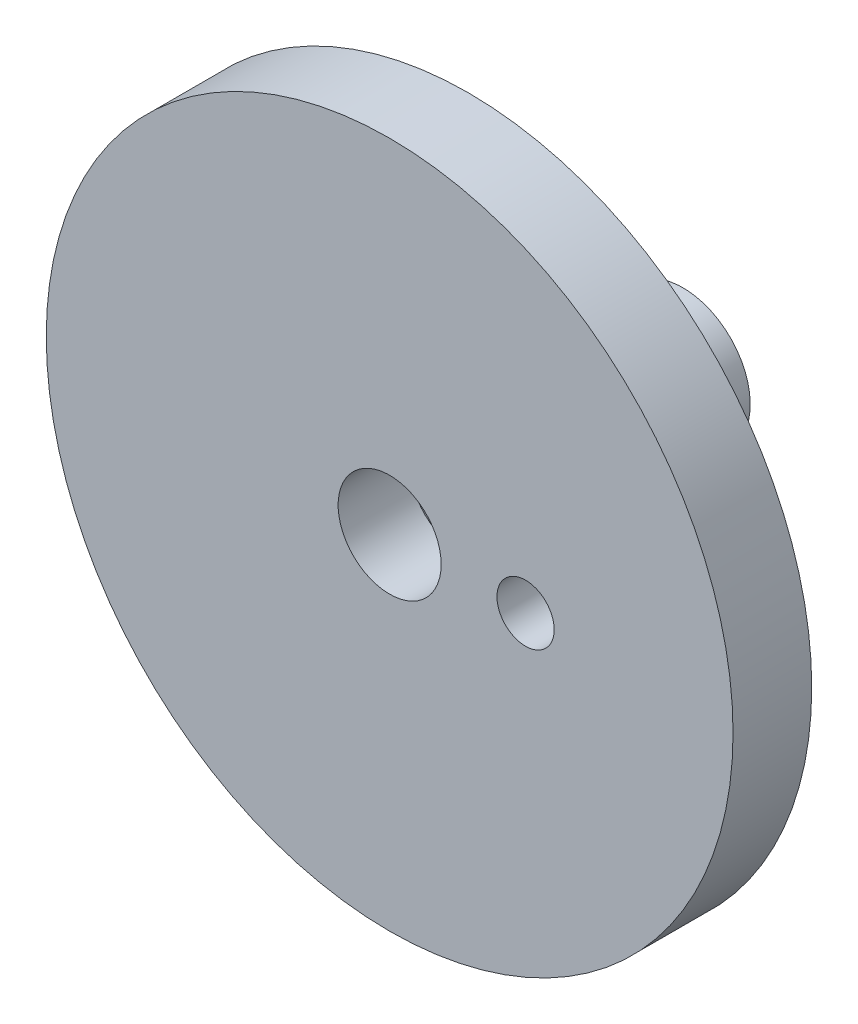
ISO-10303-21;
HEADER;
FILE_DESCRIPTION(('STEP AP214'),'2;1');
FILE_NAME('part.step','',(''),(''),'','','');
FILE_SCHEMA(('AUTOMOTIVE_DESIGN { 1 0 10303 214 1 1 1 1 }'));
ENDSEC;
DATA;
#1=APPLICATION_CONTEXT('core data for automotive mechanical design processes');
#2=APPLICATION_PROTOCOL_DEFINITION('international standard','automotive_design',2000,#1);
#3=PRODUCT_CONTEXT('',#1,'mechanical');
#4=PRODUCT('Part','Part','',(#3));
#5=PRODUCT_RELATED_PRODUCT_CATEGORY('part','',(#4));
#6=PRODUCT_DEFINITION_FORMATION('','',#4);
#7=PRODUCT_DEFINITION_CONTEXT('part definition',#1,'design');
#8=PRODUCT_DEFINITION('design','',#6,#7);
#9=PRODUCT_DEFINITION_SHAPE('','',#8);
#10=(LENGTH_UNIT() NAMED_UNIT(*) SI_UNIT(.MILLI.,.METRE.));
#11=(NAMED_UNIT(*) PLANE_ANGLE_UNIT() SI_UNIT($,.RADIAN.));
#12=(NAMED_UNIT(*) SI_UNIT($,.STERADIAN.) SOLID_ANGLE_UNIT());
#13=UNCERTAINTY_MEASURE_WITH_UNIT(LENGTH_MEASURE(1.E-05),#10,'distance_accuracy_value','');
#14=(GEOMETRIC_REPRESENTATION_CONTEXT(3) GLOBAL_UNCERTAINTY_ASSIGNED_CONTEXT((#13)) GLOBAL_UNIT_ASSIGNED_CONTEXT((#10,
#11,#12)) REPRESENTATION_CONTEXT('',''));
#15=CARTESIAN_POINT('',(0.,0.,0.));
#16=DIRECTION('',(0.,0.,1.));
#17=DIRECTION('',(1.,0.,0.));
#18=AXIS2_PLACEMENT_3D('',#15,#16,#17);
#19=CARTESIAN_POINT('',(0.,0.,-19.5));
#20=DIRECTION('',(0.,0.,1.));
#21=DIRECTION('',(1.,0.,0.));
#22=AXIS2_PLACEMENT_3D('',#19,#20,#21);
#23=CYLINDRICAL_SURFACE('',#22,7.5);
#24=CARTESIAN_POINT('',(0.,0.,0.5));
#25=DIRECTION('',(0.,0.,1.));
#26=DIRECTION('',(1.,0.,0.));
#27=AXIS2_PLACEMENT_3D('',#24,#25,#26);
#28=CIRCLE('',#27,7.5);
#29=CARTESIAN_POINT('',(7.5,0.,0.5));
#30=VERTEX_POINT('',#29);
#31=EDGE_CURVE('E57',#30,#30,#28,.T.);
#32=ORIENTED_EDGE('',*,*,#31,.T.);
#33=EDGE_LOOP('',(#32));
#34=FACE_BOUND('',#33,.T.);
#35=CARTESIAN_POINT('',(0.,0.,-19.5));
#36=DIRECTION('',(0.,0.,1.));
#37=DIRECTION('',(1.,0.,0.));
#38=AXIS2_PLACEMENT_3D('',#35,#36,#37);
#39=CIRCLE('',#38,7.5);
#40=CARTESIAN_POINT('',(7.5,0.,-19.5));
#41=VERTEX_POINT('',#40);
#42=EDGE_CURVE('E30',#41,#41,#39,.F.);
#43=ORIENTED_EDGE('',*,*,#42,.T.);
#44=EDGE_LOOP('',(#43));
#45=FACE_BOUND('',#44,.T.);
#46=ADVANCED_FACE('F14',(#34,#45),#23,.F.);
#47=CARTESIAN_POINT('',(0.,0.,-20.));
#48=DIRECTION('',(0.,0.,1.));
#49=DIRECTION('',(0.,-1.,0.));
#50=AXIS2_PLACEMENT_3D('',#47,#48,#49);
#51=CONICAL_SURFACE('',#50,7.2,0.540419500270582);
#52=ORIENTED_EDGE('',*,*,#42,.F.);
#53=EDGE_LOOP('',(#52));
#54=FACE_BOUND('',#53,.T.);
#55=CARTESIAN_POINT('',(0.,0.,-20.));
#56=DIRECTION('',(0.,0.,1.));
#57=DIRECTION('',(1.,0.,0.));
#58=AXIS2_PLACEMENT_3D('',#55,#56,#57);
#59=CIRCLE('',#58,7.2);
#60=CARTESIAN_POINT('',(7.2,0.,-20.));
#61=VERTEX_POINT('',#60);
#62=EDGE_CURVE('E52',#61,#61,#59,.F.);
#63=ORIENTED_EDGE('',*,*,#62,.T.);
#64=EDGE_LOOP('',(#63));
#65=FACE_BOUND('',#64,.T.);
#66=ADVANCED_FACE('F66',(#54,#65),#51,.F.);
#67=CARTESIAN_POINT('',(0.,0.,0.5));
#68=DIRECTION('',(0.,0.,-1.));
#69=DIRECTION('',(-1.,0.,0.));
#70=AXIS2_PLACEMENT_3D('',#67,#68,#69);
#71=CONICAL_SURFACE('',#70,7.5,0.540419500270583);
#72=CARTESIAN_POINT('',(0.,0.,1.));
#73=DIRECTION('',(0.,0.,1.));
#74=DIRECTION('',(1.,0.,0.));
#75=AXIS2_PLACEMENT_3D('',#72,#73,#74);
#76=CIRCLE('',#75,7.2);
#77=CARTESIAN_POINT('',(7.2,0.,1.));
#78=VERTEX_POINT('',#77);
#79=EDGE_CURVE('E48',#78,#78,#76,.T.);
#80=ORIENTED_EDGE('',*,*,#79,.T.);
#81=EDGE_LOOP('',(#80));
#82=FACE_BOUND('',#81,.T.);
#83=ORIENTED_EDGE('',*,*,#31,.F.);
#84=EDGE_LOOP('',(#83));
#85=FACE_BOUND('',#84,.T.);
#86=ADVANCED_FACE('F69',(#82,#85),#71,.F.);
#87=CARTESIAN_POINT('',(0.,0.,-30.));
#88=DIRECTION('',(0.,0.,1.));
#89=DIRECTION('',(0.,-1.,0.));
#90=AXIS2_PLACEMENT_3D('',#87,#88,#89);
#91=CYLINDRICAL_SURFACE('',#90,7.2);
#92=ORIENTED_EDGE('',*,*,#62,.F.);
#93=EDGE_LOOP('',(#92));
#94=FACE_BOUND('',#93,.T.);
#95=CARTESIAN_POINT('',(0.,0.,-30.));
#96=DIRECTION('',(0.,0.,1.));
#97=DIRECTION('',(0.,-1.,0.));
#98=AXIS2_PLACEMENT_3D('',#95,#96,#97);
#99=CIRCLE('',#98,7.2);
#100=CARTESIAN_POINT('',(0.,-7.2,-30.));
#101=VERTEX_POINT('',#100);
#102=EDGE_CURVE('E18',#101,#101,#99,.F.);
#103=ORIENTED_EDGE('',*,*,#102,.T.);
#104=EDGE_LOOP('',(#103));
#105=FACE_BOUND('',#104,.T.);
#106=ADVANCED_FACE('F73',(#94,#105),#91,.F.);
#107=CARTESIAN_POINT('',(0.,0.,1.));
#108=DIRECTION('',(0.,0.,1.));
#109=DIRECTION('',(1.,0.,0.));
#110=AXIS2_PLACEMENT_3D('',#107,#108,#109);
#111=CYLINDRICAL_SURFACE('',#110,7.2);
#112=ORIENTED_EDGE('',*,*,#79,.F.);
#113=EDGE_LOOP('',(#112));
#114=FACE_BOUND('',#113,.T.);
#115=CARTESIAN_POINT('',(0.,0.,11.));
#116=DIRECTION('',(0.,0.,1.));
#117=DIRECTION('',(1.,0.,0.));
#118=AXIS2_PLACEMENT_3D('',#115,#116,#117);
#119=CIRCLE('',#118,7.2);
#120=CARTESIAN_POINT('',(7.2,0.,11.));
#121=VERTEX_POINT('',#120);
#122=EDGE_CURVE('E43',#121,#121,#119,.T.);
#123=ORIENTED_EDGE('',*,*,#122,.T.);
#124=EDGE_LOOP('',(#123));
#125=FACE_BOUND('',#124,.T.);
#126=ADVANCED_FACE('F75',(#114,#125),#111,.F.);
#127=CARTESIAN_POINT('',(-9.4,-9.411696541518,-30.));
#128=DIRECTION('',(0.,0.,1.));
#129=DIRECTION('',(1.,0.,0.));
#130=AXIS2_PLACEMENT_3D('',#127,#128,#129);
#131=PLANE('',#130);
#132=ORIENTED_EDGE('',*,*,#102,.F.);
#133=EDGE_LOOP('',(#132));
#134=FACE_BOUND('',#133,.T.);
#135=CARTESIAN_POINT('',(0.,0.,-30.));
#136=DIRECTION('',(0.,0.,1.));
#137=DIRECTION('',(0.,-1.,0.));
#138=AXIS2_PLACEMENT_3D('',#135,#136,#137);
#139=CIRCLE('',#138,9.4);
#140=CARTESIAN_POINT('',(0.,-9.4,-30.));
#141=VERTEX_POINT('',#140);
#142=EDGE_CURVE('E38',#141,#141,#139,.F.);
#143=ORIENTED_EDGE('',*,*,#142,.T.);
#144=EDGE_LOOP('',(#143));
#145=FACE_BOUND('',#144,.T.);
#146=ADVANCED_FACE('F82',(#134,#145),#131,.F.);
#147=CARTESIAN_POINT('',(-48.,-48.96,11.));
#148=DIRECTION('',(0.,0.,1.));
#149=DIRECTION('',(1.,0.,0.));
#150=AXIS2_PLACEMENT_3D('',#147,#148,#149);
#151=PLANE('',#150);
#152=CARTESIAN_POINT('',(19.,0.,11.));
#153=DIRECTION('',(0.,0.,-1.));
#154=DIRECTION('',(-1.,0.,0.));
#155=AXIS2_PLACEMENT_3D('',#152,#153,#154);
#156=CIRCLE('',#155,4.);
#157=CARTESIAN_POINT('',(15.,0.,11.));
#158=VERTEX_POINT('',#157);
#159=EDGE_CURVE('E35',#158,#158,#156,.T.);
#160=ORIENTED_EDGE('',*,*,#159,.T.);
#161=EDGE_LOOP('',(#160));
#162=FACE_BOUND('',#161,.T.);
#163=ORIENTED_EDGE('',*,*,#122,.F.);
#164=EDGE_LOOP('',(#163));
#165=FACE_BOUND('',#164,.T.);
#166=CARTESIAN_POINT('',(0.,0.,11.));
#167=DIRECTION('',(0.,0.,1.));
#168=DIRECTION('',(1.,0.,0.));
#169=AXIS2_PLACEMENT_3D('',#166,#167,#168);
#170=CIRCLE('',#169,48.);
#171=CARTESIAN_POINT('',(48.,0.,11.));
#172=VERTEX_POINT('',#171);
#173=EDGE_CURVE('E41',#172,#172,#170,.T.);
#174=ORIENTED_EDGE('',*,*,#173,.T.);
#175=EDGE_LOOP('',(#174));
#176=FACE_BOUND('',#175,.T.);
#177=ADVANCED_FACE('F102',(#162,#165,#176),#151,.T.);
#178=CARTESIAN_POINT('',(0.,0.,0.));
#179=DIRECTION('',(0.,0.,1.));
#180=DIRECTION('',(1.,0.,0.));
#181=AXIS2_PLACEMENT_3D('',#178,#179,#180);
#182=CYLINDRICAL_SURFACE('',#181,48.);
#183=ORIENTED_EDGE('',*,*,#173,.F.);
#184=EDGE_LOOP('',(#183));
#185=FACE_BOUND('',#184,.T.);
#186=CARTESIAN_POINT('',(0.,0.,0.));
#187=DIRECTION('',(0.,0.,1.));
#188=DIRECTION('',(1.,0.,0.));
#189=AXIS2_PLACEMENT_3D('',#186,#187,#188);
#190=CIRCLE('',#189,48.);
#191=CARTESIAN_POINT('',(48.,0.,0.));
#192=VERTEX_POINT('',#191);
#193=EDGE_CURVE('E27',#192,#192,#190,.T.);
#194=ORIENTED_EDGE('',*,*,#193,.T.);
#195=EDGE_LOOP('',(#194));
#196=FACE_BOUND('',#195,.T.);
#197=ADVANCED_FACE('F100',(#185,#196),#182,.T.);
#198=CARTESIAN_POINT('',(0.,0.,-30.));
#199=DIRECTION('',(0.,0.,1.));
#200=DIRECTION('',(0.,-1.,0.));
#201=AXIS2_PLACEMENT_3D('',#198,#199,#200);
#202=CYLINDRICAL_SURFACE('',#201,9.4);
#203=ORIENTED_EDGE('',*,*,#142,.F.);
#204=EDGE_LOOP('',(#203));
#205=FACE_BOUND('',#204,.T.);
#206=CARTESIAN_POINT('',(0.,0.,0.));
#207=DIRECTION('',(0.,0.,1.));
#208=DIRECTION('',(0.,-1.,0.));
#209=AXIS2_PLACEMENT_3D('',#206,#207,#208);
#210=CIRCLE('',#209,9.4);
#211=CARTESIAN_POINT('',(0.,-9.40000000000001,0.));
#212=VERTEX_POINT('',#211);
#213=EDGE_CURVE('E22',#212,#212,#210,.F.);
#214=ORIENTED_EDGE('',*,*,#213,.T.);
#215=EDGE_LOOP('',(#214));
#216=FACE_BOUND('',#215,.T.);
#217=ADVANCED_FACE('F92',(#205,#216),#202,.T.);
#218=CARTESIAN_POINT('',(19.,0.,11.));
#219=DIRECTION('',(0.,0.,-1.));
#220=DIRECTION('',(-1.,0.,0.));
#221=AXIS2_PLACEMENT_3D('',#218,#219,#220);
#222=CYLINDRICAL_SURFACE('',#221,4.);
#223=ORIENTED_EDGE('',*,*,#159,.F.);
#224=EDGE_LOOP('',(#223));
#225=FACE_BOUND('',#224,.T.);
#226=CARTESIAN_POINT('',(19.,0.,0.));
#227=DIRECTION('',(0.,0.,-1.));
#228=DIRECTION('',(-1.,0.,0.));
#229=AXIS2_PLACEMENT_3D('',#226,#227,#228);
#230=CIRCLE('',#229,4.);
#231=CARTESIAN_POINT('',(15.,0.,0.));
#232=VERTEX_POINT('',#231);
#233=EDGE_CURVE('E10',#232,#232,#230,.T.);
#234=ORIENTED_EDGE('',*,*,#233,.T.);
#235=EDGE_LOOP('',(#234));
#236=FACE_BOUND('',#235,.T.);
#237=ADVANCED_FACE('F87',(#225,#236),#222,.F.);
#238=CARTESIAN_POINT('',(-48.,-48.96,0.));
#239=DIRECTION('',(0.,0.,1.));
#240=DIRECTION('',(1.,0.,0.));
#241=AXIS2_PLACEMENT_3D('',#238,#239,#240);
#242=PLANE('',#241);
#243=ORIENTED_EDGE('',*,*,#233,.F.);
#244=EDGE_LOOP('',(#243));
#245=FACE_BOUND('',#244,.T.);
#246=ORIENTED_EDGE('',*,*,#213,.F.);
#247=EDGE_LOOP('',(#246));
#248=FACE_BOUND('',#247,.T.);
#249=ORIENTED_EDGE('',*,*,#193,.F.);
#250=EDGE_LOOP('',(#249));
#251=FACE_BOUND('',#250,.T.);
#252=ADVANCED_FACE('F16',(#245,#248,#251),#242,.F.);
#253=CLOSED_SHELL('',(#46,#66,#86,#106,#126,#146,#177,#197,#217,#237,#252));
#254=MANIFOLD_SOLID_BREP('B1',#253);
#255=ADVANCED_BREP_SHAPE_REPRESENTATION('',(#18,#254),#14);
#256=SHAPE_DEFINITION_REPRESENTATION(#9,#255);
ENDSEC;
END-ISO-10303-21;
